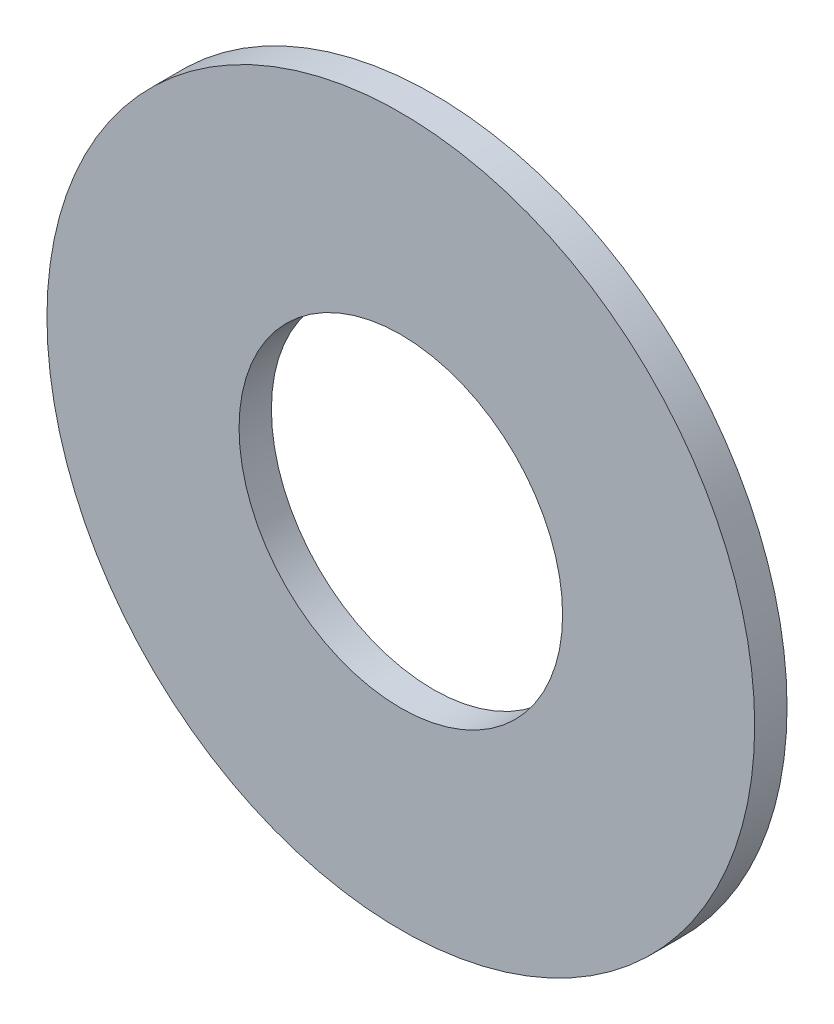
ISO-10303-21;
HEADER;
FILE_DESCRIPTION(('STEP AP214'),'2;1');
FILE_NAME('part.step','',(''),(''),'','','');
FILE_SCHEMA(('AUTOMOTIVE_DESIGN { 1 0 10303 214 1 1 1 1 }'));
ENDSEC;
DATA;
#1=APPLICATION_CONTEXT('core data for automotive mechanical design processes');
#2=APPLICATION_PROTOCOL_DEFINITION('international standard','automotive_design',2000,#1);
#3=PRODUCT_CONTEXT('',#1,'mechanical');
#4=PRODUCT('Part','Part','',(#3));
#5=PRODUCT_RELATED_PRODUCT_CATEGORY('part','',(#4));
#6=PRODUCT_DEFINITION_FORMATION('','',#4);
#7=PRODUCT_DEFINITION_CONTEXT('part definition',#1,'design');
#8=PRODUCT_DEFINITION('design','',#6,#7);
#9=PRODUCT_DEFINITION_SHAPE('','',#8);
#10=(LENGTH_UNIT() NAMED_UNIT(*) SI_UNIT(.MILLI.,.METRE.));
#11=(NAMED_UNIT(*) PLANE_ANGLE_UNIT() SI_UNIT($,.RADIAN.));
#12=(NAMED_UNIT(*) SI_UNIT($,.STERADIAN.) SOLID_ANGLE_UNIT());
#13=UNCERTAINTY_MEASURE_WITH_UNIT(LENGTH_MEASURE(1.E-05),#10,'distance_accuracy_value','');
#14=(GEOMETRIC_REPRESENTATION_CONTEXT(3) GLOBAL_UNCERTAINTY_ASSIGNED_CONTEXT((#13)) GLOBAL_UNIT_ASSIGNED_CONTEXT((#10,
#11,#12)) REPRESENTATION_CONTEXT('',''));
#15=CARTESIAN_POINT('',(0.,0.,0.));
#16=DIRECTION('',(0.,0.,1.));
#17=DIRECTION('',(1.,0.,0.));
#18=AXIS2_PLACEMENT_3D('',#15,#16,#17);
#19=CARTESIAN_POINT('',(0.,0.,-0.508));
#20=DIRECTION('',(0.,0.,1.));
#21=DIRECTION('',(1.,0.,0.));
#22=AXIS2_PLACEMENT_3D('',#19,#20,#21);
#23=CYLINDRICAL_SURFACE('',#22,5.55625);
#24=CARTESIAN_POINT('',(0.,0.,-0.508));
#25=DIRECTION('',(0.,0.,1.));
#26=DIRECTION('',(1.,0.,0.));
#27=AXIS2_PLACEMENT_3D('',#24,#25,#26);
#28=CIRCLE('',#27,5.55625);
#29=CARTESIAN_POINT('',(5.55625,0.,-0.508));
#30=VERTEX_POINT('',#29);
#31=EDGE_CURVE('E10',#30,#30,#28,.T.);
#32=ORIENTED_EDGE('',*,*,#31,.T.);
#33=EDGE_LOOP('',(#32));
#34=FACE_BOUND('',#33,.T.);
#35=CARTESIAN_POINT('',(0.,0.,0.));
#36=DIRECTION('',(0.,0.,1.));
#37=DIRECTION('',(1.,0.,0.));
#38=AXIS2_PLACEMENT_3D('',#35,#36,#37);
#39=CIRCLE('',#38,5.55625);
#40=CARTESIAN_POINT('',(5.55625,0.,0.));
#41=VERTEX_POINT('',#40);
#42=EDGE_CURVE('E33',#41,#41,#39,.T.);
#43=ORIENTED_EDGE('',*,*,#42,.F.);
#44=EDGE_LOOP('',(#43));
#45=FACE_BOUND('',#44,.T.);
#46=ADVANCED_FACE('F30',(#34,#45),#23,.T.);
#47=CARTESIAN_POINT('',(0.,0.,-0.508));
#48=DIRECTION('',(0.,0.,1.));
#49=DIRECTION('',(1.,0.,0.));
#50=AXIS2_PLACEMENT_3D('',#47,#48,#49);
#51=PLANE('',#50);
#52=CARTESIAN_POINT('',(0.,0.,-0.508));
#53=DIRECTION('',(0.,0.,1.));
#54=DIRECTION('',(1.,0.,0.));
#55=AXIS2_PLACEMENT_3D('',#52,#53,#54);
#56=CIRCLE('',#55,2.54);
#57=CARTESIAN_POINT('',(2.54,0.,-0.508));
#58=VERTEX_POINT('',#57);
#59=EDGE_CURVE('E40',#58,#58,#56,.T.);
#60=ORIENTED_EDGE('',*,*,#59,.T.);
#61=EDGE_LOOP('',(#60));
#62=FACE_BOUND('',#61,.T.);
#63=ORIENTED_EDGE('',*,*,#31,.F.);
#64=EDGE_LOOP('',(#63));
#65=FACE_BOUND('',#64,.T.);
#66=ADVANCED_FACE('F48',(#62,#65),#51,.F.);
#67=CARTESIAN_POINT('',(0.,0.,0.));
#68=DIRECTION('',(0.,0.,1.));
#69=DIRECTION('',(1.,0.,0.));
#70=AXIS2_PLACEMENT_3D('',#67,#68,#69);
#71=PLANE('',#70);
#72=CARTESIAN_POINT('',(0.,0.,0.));
#73=DIRECTION('',(0.,0.,1.));
#74=DIRECTION('',(1.,0.,0.));
#75=AXIS2_PLACEMENT_3D('',#72,#73,#74);
#76=CIRCLE('',#75,2.54);
#77=CARTESIAN_POINT('',(2.54,0.,0.));
#78=VERTEX_POINT('',#77);
#79=EDGE_CURVE('E42',#78,#78,#76,.T.);
#80=ORIENTED_EDGE('',*,*,#79,.F.);
#81=EDGE_LOOP('',(#80));
#82=FACE_BOUND('',#81,.T.);
#83=ORIENTED_EDGE('',*,*,#42,.T.);
#84=EDGE_LOOP('',(#83));
#85=FACE_BOUND('',#84,.T.);
#86=ADVANCED_FACE('F54',(#82,#85),#71,.T.);
#87=CARTESIAN_POINT('',(0.,0.,-0.508));
#88=DIRECTION('',(0.,0.,1.));
#89=DIRECTION('',(1.,0.,0.));
#90=AXIS2_PLACEMENT_3D('',#87,#88,#89);
#91=CYLINDRICAL_SURFACE('',#90,2.54);
#92=ORIENTED_EDGE('',*,*,#59,.F.);
#93=EDGE_LOOP('',(#92));
#94=FACE_BOUND('',#93,.T.);
#95=ORIENTED_EDGE('',*,*,#79,.T.);
#96=EDGE_LOOP('',(#95));
#97=FACE_BOUND('',#96,.T.);
#98=ADVANCED_FACE('F51',(#94,#97),#91,.F.);
#99=CLOSED_SHELL('',(#46,#66,#86,#98));
#100=MANIFOLD_SOLID_BREP('B2',#99);
#101=ADVANCED_BREP_SHAPE_REPRESENTATION('',(#18,#100),#14);
#102=SHAPE_DEFINITION_REPRESENTATION(#9,#101);
ENDSEC;
END-ISO-10303-21;
